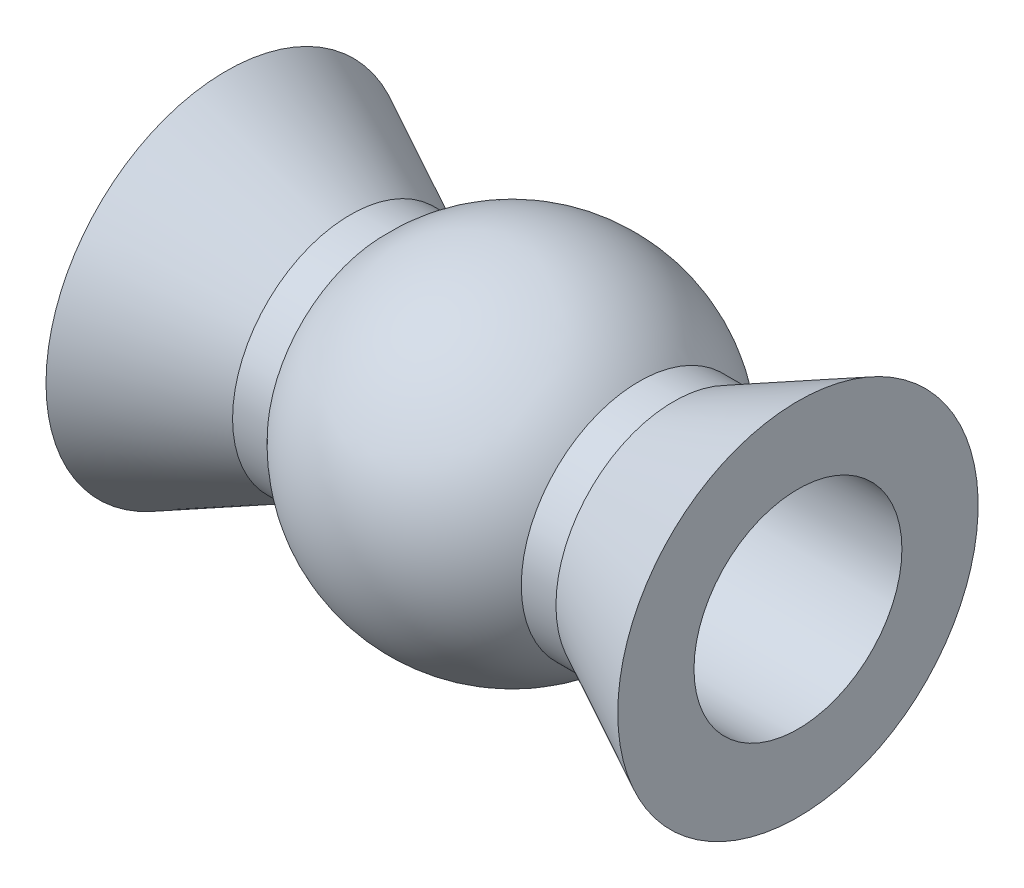
ISO-10303-21;
HEADER;
FILE_DESCRIPTION(('STEP AP214'),'2;1');
FILE_NAME('part.step','',(''),(''),'','','');
FILE_SCHEMA(('AUTOMOTIVE_DESIGN { 1 0 10303 214 1 1 1 1 }'));
ENDSEC;
DATA;
#1=APPLICATION_CONTEXT('core data for automotive mechanical design processes');
#2=APPLICATION_PROTOCOL_DEFINITION('international standard','automotive_design',2000,#1);
#3=PRODUCT_CONTEXT('',#1,'mechanical');
#4=PRODUCT('Part','Part','',(#3));
#5=PRODUCT_RELATED_PRODUCT_CATEGORY('part','',(#4));
#6=PRODUCT_DEFINITION_FORMATION('','',#4);
#7=PRODUCT_DEFINITION_CONTEXT('part definition',#1,'design');
#8=PRODUCT_DEFINITION('design','',#6,#7);
#9=PRODUCT_DEFINITION_SHAPE('','',#8);
#10=(LENGTH_UNIT() NAMED_UNIT(*) SI_UNIT(.MILLI.,.METRE.));
#11=(NAMED_UNIT(*) PLANE_ANGLE_UNIT() SI_UNIT($,.RADIAN.));
#12=(NAMED_UNIT(*) SI_UNIT($,.STERADIAN.) SOLID_ANGLE_UNIT());
#13=UNCERTAINTY_MEASURE_WITH_UNIT(LENGTH_MEASURE(1.E-05),#10,'distance_accuracy_value','');
#14=(GEOMETRIC_REPRESENTATION_CONTEXT(3) GLOBAL_UNCERTAINTY_ASSIGNED_CONTEXT((#13)) GLOBAL_UNIT_ASSIGNED_CONTEXT((#10,
#11,#12)) REPRESENTATION_CONTEXT('',''));
#15=CARTESIAN_POINT('',(0.,0.,0.));
#16=DIRECTION('',(0.,0.,1.));
#17=DIRECTION('',(1.,0.,0.));
#18=AXIS2_PLACEMENT_3D('',#15,#16,#17);
#19=CARTESIAN_POINT('',(-4.125,0.,0.));
#20=DIRECTION('',(1.,0.,0.));
#21=DIRECTION('',(0.,0.,-1.));
#22=AXIS2_PLACEMENT_3D('',#19,#20,#21);
#23=PLANE('',#22);
#24=CARTESIAN_POINT('',(-4.125,0.,0.));
#25=DIRECTION('',(1.,0.,0.));
#26=DIRECTION('',(0.,0.,-1.));
#27=AXIS2_PLACEMENT_3D('',#24,#25,#26);
#28=CIRCLE('',#27,1.5);
#29=CARTESIAN_POINT('',(-4.125,0.,-1.5));
#30=VERTEX_POINT('',#29);
#31=EDGE_CURVE('E55',#30,#30,#28,.T.);
#32=ORIENTED_EDGE('',*,*,#31,.T.);
#33=EDGE_LOOP('',(#32));
#34=FACE_BOUND('',#33,.T.);
#35=CARTESIAN_POINT('',(-4.125,0.,0.));
#36=DIRECTION('',(-1.,0.,0.));
#37=DIRECTION('',(0.,0.,1.));
#38=AXIS2_PLACEMENT_3D('',#35,#36,#37);
#39=CIRCLE('',#38,2.6);
#40=CARTESIAN_POINT('',(-4.125,0.,2.6));
#41=VERTEX_POINT('',#40);
#42=EDGE_CURVE('E10',#41,#41,#39,.T.);
#43=ORIENTED_EDGE('',*,*,#42,.T.);
#44=EDGE_LOOP('',(#43));
#45=FACE_BOUND('',#44,.T.);
#46=ADVANCED_FACE('F30',(#34,#45),#23,.F.);
#47=CARTESIAN_POINT('',(-2.33303027798234,0.,0.));
#48=DIRECTION('',(-1.,0.,0.));
#49=DIRECTION('',(0.,0.,1.));
#50=AXIS2_PLACEMENT_3D('',#47,#48,#49);
#51=CONICAL_SURFACE('',#50,1.7,0.465438505041524);
#52=ORIENTED_EDGE('',*,*,#42,.F.);
#53=EDGE_LOOP('',(#52));
#54=FACE_BOUND('',#53,.T.);
#55=CARTESIAN_POINT('',(-2.33303027798234,0.,0.));
#56=DIRECTION('',(-1.,0.,0.));
#57=DIRECTION('',(0.,0.,1.));
#58=AXIS2_PLACEMENT_3D('',#55,#56,#57);
#59=CIRCLE('',#58,1.7);
#60=CARTESIAN_POINT('',(-2.33303027798234,0.,1.7));
#61=VERTEX_POINT('',#60);
#62=EDGE_CURVE('E36',#61,#61,#59,.T.);
#63=ORIENTED_EDGE('',*,*,#62,.T.);
#64=EDGE_LOOP('',(#63));
#65=FACE_BOUND('',#64,.T.);
#66=ADVANCED_FACE('F88',(#54,#65),#51,.T.);
#67=CARTESIAN_POINT('',(-4.125,0.,0.));
#68=DIRECTION('',(-1.,0.,0.));
#69=DIRECTION('',(0.,0.,1.));
#70=AXIS2_PLACEMENT_3D('',#67,#68,#69);
#71=CYLINDRICAL_SURFACE('',#70,1.7);
#72=ORIENTED_EDGE('',*,*,#62,.F.);
#73=EDGE_LOOP('',(#72));
#74=FACE_BOUND('',#73,.T.);
#75=CARTESIAN_POINT('',(-1.83303027798234,0.,0.));
#76=DIRECTION('',(-1.,0.,0.));
#77=DIRECTION('',(0.,0.,1.));
#78=AXIS2_PLACEMENT_3D('',#75,#76,#77);
#79=CIRCLE('',#78,1.7);
#80=CARTESIAN_POINT('',(-1.83303027798234,0.,1.7));
#81=VERTEX_POINT('',#80);
#82=EDGE_CURVE('E40',#81,#81,#79,.T.);
#83=ORIENTED_EDGE('',*,*,#82,.T.);
#84=EDGE_LOOP('',(#83));
#85=FACE_BOUND('',#84,.T.);
#86=ADVANCED_FACE('F92',(#74,#85),#71,.T.);
#87=CARTESIAN_POINT('',(0.,0.,0.));
#88=DIRECTION('',(-1.,0.,0.));
#89=DIRECTION('',(0.,0.,-1.));
#90=AXIS2_PLACEMENT_3D('',#87,#88,#89);
#91=SPHERICAL_SURFACE('',#90,2.5);
#92=ORIENTED_EDGE('',*,*,#82,.F.);
#93=EDGE_LOOP('',(#92));
#94=FACE_BOUND('',#93,.T.);
#95=CARTESIAN_POINT('',(1.83303027798234,0.,0.));
#96=DIRECTION('',(-1.,0.,0.));
#97=DIRECTION('',(0.,0.,1.));
#98=AXIS2_PLACEMENT_3D('',#95,#96,#97);
#99=CIRCLE('',#98,1.7);
#100=CARTESIAN_POINT('',(1.83303027798234,0.,1.7));
#101=VERTEX_POINT('',#100);
#102=EDGE_CURVE('E44',#101,#101,#99,.T.);
#103=ORIENTED_EDGE('',*,*,#102,.T.);
#104=EDGE_LOOP('',(#103));
#105=FACE_BOUND('',#104,.T.);
#106=ADVANCED_FACE('F83',(#94,#105),#91,.T.);
#107=CARTESIAN_POINT('',(-4.125,0.,0.));
#108=DIRECTION('',(-1.,0.,0.));
#109=DIRECTION('',(0.,0.,1.));
#110=AXIS2_PLACEMENT_3D('',#107,#108,#109);
#111=CYLINDRICAL_SURFACE('',#110,1.7);
#112=ORIENTED_EDGE('',*,*,#102,.F.);
#113=EDGE_LOOP('',(#112));
#114=FACE_BOUND('',#113,.T.);
#115=CARTESIAN_POINT('',(2.33303027798234,0.,0.));
#116=DIRECTION('',(-1.,0.,0.));
#117=DIRECTION('',(0.,0.,1.));
#118=AXIS2_PLACEMENT_3D('',#115,#116,#117);
#119=CIRCLE('',#118,1.7);
#120=CARTESIAN_POINT('',(2.33303027798234,0.,1.7));
#121=VERTEX_POINT('',#120);
#122=EDGE_CURVE('E49',#121,#121,#119,.T.);
#123=ORIENTED_EDGE('',*,*,#122,.T.);
#124=EDGE_LOOP('',(#123));
#125=FACE_BOUND('',#124,.T.);
#126=ADVANCED_FACE('F77',(#114,#125),#111,.T.);
#127=CARTESIAN_POINT('',(4.125,0.,0.));
#128=DIRECTION('',(1.,0.,0.));
#129=DIRECTION('',(0.,0.,-1.));
#130=AXIS2_PLACEMENT_3D('',#127,#128,#129);
#131=CONICAL_SURFACE('',#130,2.6,0.465438505041524);
#132=ORIENTED_EDGE('',*,*,#122,.F.);
#133=EDGE_LOOP('',(#132));
#134=FACE_BOUND('',#133,.T.);
#135=CARTESIAN_POINT('',(4.125,0.,0.));
#136=DIRECTION('',(-1.,0.,0.));
#137=DIRECTION('',(0.,0.,1.));
#138=AXIS2_PLACEMENT_3D('',#135,#136,#137);
#139=CIRCLE('',#138,2.6);
#140=CARTESIAN_POINT('',(4.125,0.,2.6));
#141=VERTEX_POINT('',#140);
#142=EDGE_CURVE('E52',#141,#141,#139,.T.);
#143=ORIENTED_EDGE('',*,*,#142,.T.);
#144=EDGE_LOOP('',(#143));
#145=FACE_BOUND('',#144,.T.);
#146=ADVANCED_FACE('F72',(#134,#145),#131,.T.);
#147=CARTESIAN_POINT('',(4.125,0.,0.));
#148=DIRECTION('',(-1.,0.,0.));
#149=DIRECTION('',(0.,0.,1.));
#150=AXIS2_PLACEMENT_3D('',#147,#148,#149);
#151=PLANE('',#150);
#152=CARTESIAN_POINT('',(4.125,0.,0.));
#153=DIRECTION('',(1.,0.,0.));
#154=DIRECTION('',(0.,0.,-1.));
#155=AXIS2_PLACEMENT_3D('',#152,#153,#154);
#156=CIRCLE('',#155,1.5);
#157=CARTESIAN_POINT('',(4.125,0.,-1.5));
#158=VERTEX_POINT('',#157);
#159=EDGE_CURVE('E56',#158,#158,#156,.T.);
#160=ORIENTED_EDGE('',*,*,#159,.F.);
#161=EDGE_LOOP('',(#160));
#162=FACE_BOUND('',#161,.T.);
#163=ORIENTED_EDGE('',*,*,#142,.F.);
#164=EDGE_LOOP('',(#163));
#165=FACE_BOUND('',#164,.T.);
#166=ADVANCED_FACE('F66',(#162,#165),#151,.F.);
#167=CARTESIAN_POINT('',(-4.125,0.,0.));
#168=DIRECTION('',(1.,0.,0.));
#169=DIRECTION('',(0.,0.,-1.));
#170=AXIS2_PLACEMENT_3D('',#167,#168,#169);
#171=CYLINDRICAL_SURFACE('',#170,1.5);
#172=ORIENTED_EDGE('',*,*,#31,.F.);
#173=EDGE_LOOP('',(#172));
#174=FACE_BOUND('',#173,.T.);
#175=ORIENTED_EDGE('',*,*,#159,.T.);
#176=EDGE_LOOP('',(#175));
#177=FACE_BOUND('',#176,.T.);
#178=ADVANCED_FACE('F63',(#174,#177),#171,.F.);
#179=CLOSED_SHELL('',(#46,#66,#86,#106,#126,#146,#166,#178));
#180=MANIFOLD_SOLID_BREP('B2',#179);
#181=ADVANCED_BREP_SHAPE_REPRESENTATION('',(#18,#180),#14);
#182=SHAPE_DEFINITION_REPRESENTATION(#9,#181);
ENDSEC;
END-ISO-10303-21;
